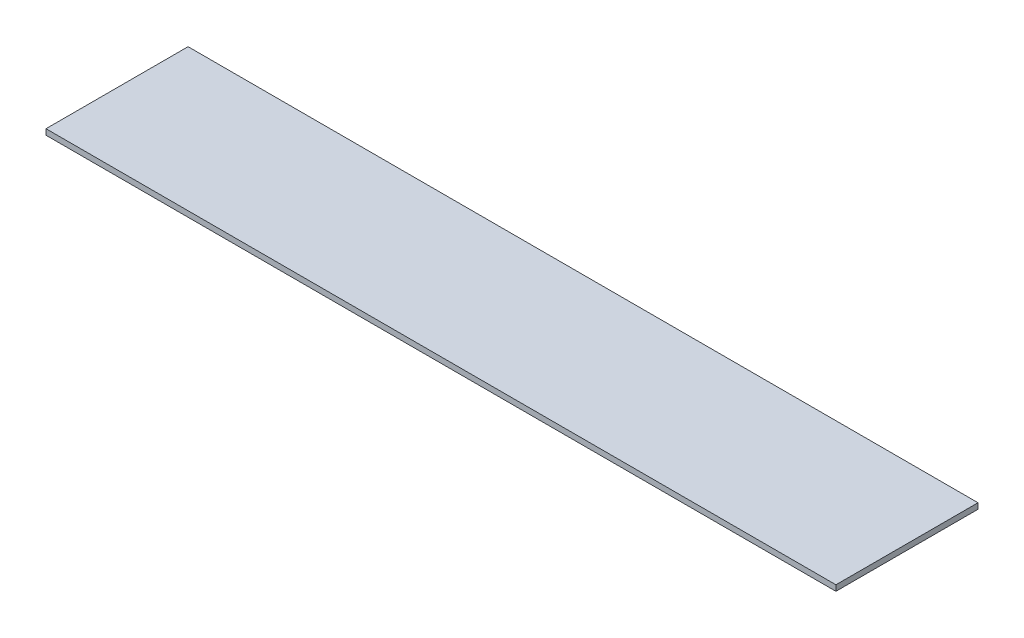
ISO-10303-21;
HEADER;
FILE_DESCRIPTION(('STEP AP214'),'2;1');
FILE_NAME('part.step','',(''),(''),'','','');
FILE_SCHEMA(('AUTOMOTIVE_DESIGN { 1 0 10303 214 1 1 1 1 }'));
ENDSEC;
DATA;
#1=APPLICATION_CONTEXT('core data for automotive mechanical design processes');
#2=APPLICATION_PROTOCOL_DEFINITION('international standard','automotive_design',2000,#1);
#3=PRODUCT_CONTEXT('',#1,'mechanical');
#4=PRODUCT('Part','Part','',(#3));
#5=PRODUCT_RELATED_PRODUCT_CATEGORY('part','',(#4));
#6=PRODUCT_DEFINITION_FORMATION('','',#4);
#7=PRODUCT_DEFINITION_CONTEXT('part definition',#1,'design');
#8=PRODUCT_DEFINITION('design','',#6,#7);
#9=PRODUCT_DEFINITION_SHAPE('','',#8);
#10=(LENGTH_UNIT() NAMED_UNIT(*) SI_UNIT(.MILLI.,.METRE.));
#11=(NAMED_UNIT(*) PLANE_ANGLE_UNIT() SI_UNIT($,.RADIAN.));
#12=(NAMED_UNIT(*) SI_UNIT($,.STERADIAN.) SOLID_ANGLE_UNIT());
#13=UNCERTAINTY_MEASURE_WITH_UNIT(LENGTH_MEASURE(1.E-05),#10,'distance_accuracy_value','');
#14=(GEOMETRIC_REPRESENTATION_CONTEXT(3) GLOBAL_UNCERTAINTY_ASSIGNED_CONTEXT((#13)) GLOBAL_UNIT_ASSIGNED_CONTEXT((#10,
#11,#12)) REPRESENTATION_CONTEXT('',''));
#15=CARTESIAN_POINT('',(0.,0.,0.));
#16=DIRECTION('',(0.,0.,1.));
#17=DIRECTION('',(1.,0.,0.));
#18=AXIS2_PLACEMENT_3D('',#15,#16,#17);
#19=CARTESIAN_POINT('',(0.,2.,0.));
#20=DIRECTION('',(1.,0.,0.));
#21=DIRECTION('',(0.,0.,-1.));
#22=AXIS2_PLACEMENT_3D('',#19,#20,#21);
#23=PLANE('',#22);
#24=DIRECTION('',(0.,0.,1.));
#25=VECTOR('',#24,1.);
#26=CARTESIAN_POINT('',(0.,0.,0.));
#27=LINE('',#26,#25);
#28=CARTESIAN_POINT('',(0.,0.,-50.));
#29=VERTEX_POINT('',#28);
#30=CARTESIAN_POINT('',(0.,0.,0.));
#31=VERTEX_POINT('',#30);
#32=EDGE_CURVE('E96',#29,#31,#27,.T.);
#33=ORIENTED_EDGE('',*,*,#32,.T.);
#34=DIRECTION('',(0.,-1.,0.));
#35=VECTOR('',#34,1.);
#36=CARTESIAN_POINT('',(0.,2.,0.));
#37=LINE('',#36,#35);
#38=CARTESIAN_POINT('',(0.,2.,0.));
#39=VERTEX_POINT('',#38);
#40=EDGE_CURVE('E11',#39,#31,#37,.T.);
#41=ORIENTED_EDGE('',*,*,#40,.F.);
#42=DIRECTION('',(0.,0.,1.));
#43=VECTOR('',#42,1.);
#44=CARTESIAN_POINT('',(0.,2.,0.));
#45=LINE('',#44,#43);
#46=CARTESIAN_POINT('',(0.,2.,-50.));
#47=VERTEX_POINT('',#46);
#48=EDGE_CURVE('E84',#47,#39,#45,.T.);
#49=ORIENTED_EDGE('',*,*,#48,.F.);
#50=DIRECTION('',(0.,-1.,0.));
#51=VECTOR('',#50,1.);
#52=CARTESIAN_POINT('',(0.,2.,-50.));
#53=LINE('',#52,#51);
#54=EDGE_CURVE('E92',#47,#29,#53,.T.);
#55=ORIENTED_EDGE('',*,*,#54,.T.);
#56=EDGE_LOOP('',(#33,#41,#49,#55));
#57=FACE_BOUND('',#56,.T.);
#58=ADVANCED_FACE('F33',(#57),#23,.F.);
#59=CARTESIAN_POINT('',(0.,2.,0.));
#60=DIRECTION('',(0.,0.,-1.));
#61=DIRECTION('',(-1.,0.,0.));
#62=AXIS2_PLACEMENT_3D('',#59,#60,#61);
#63=PLANE('',#62);
#64=DIRECTION('',(1.,0.,0.));
#65=VECTOR('',#64,1.);
#66=CARTESIAN_POINT('',(0.,0.,0.));
#67=LINE('',#66,#65);
#68=CARTESIAN_POINT('',(278.,0.,0.));
#69=VERTEX_POINT('',#68);
#70=EDGE_CURVE('E88',#31,#69,#67,.T.);
#71=ORIENTED_EDGE('',*,*,#70,.T.);
#72=DIRECTION('',(0.,-1.,0.));
#73=VECTOR('',#72,1.);
#74=CARTESIAN_POINT('',(278.,2.,0.));
#75=LINE('',#74,#73);
#76=CARTESIAN_POINT('',(278.,2.,0.));
#77=VERTEX_POINT('',#76);
#78=EDGE_CURVE('E41',#77,#69,#75,.T.);
#79=ORIENTED_EDGE('',*,*,#78,.F.);
#80=DIRECTION('',(1.,0.,0.));
#81=VECTOR('',#80,1.);
#82=CARTESIAN_POINT('',(0.,2.,0.));
#83=LINE('',#82,#81);
#84=EDGE_CURVE('E79',#39,#77,#83,.T.);
#85=ORIENTED_EDGE('',*,*,#84,.F.);
#86=ORIENTED_EDGE('',*,*,#40,.T.);
#87=EDGE_LOOP('',(#71,#79,#85,#86));
#88=FACE_BOUND('',#87,.T.);
#89=ADVANCED_FACE('F87',(#88),#63,.F.);
#90=CARTESIAN_POINT('',(278.,2.,0.));
#91=DIRECTION('',(-1.,0.,0.));
#92=DIRECTION('',(0.,0.,1.));
#93=AXIS2_PLACEMENT_3D('',#90,#91,#92);
#94=PLANE('',#93);
#95=DIRECTION('',(0.,0.,-1.));
#96=VECTOR('',#95,1.);
#97=CARTESIAN_POINT('',(278.,0.,0.));
#98=LINE('',#97,#96);
#99=CARTESIAN_POINT('',(278.,0.,-50.));
#100=VERTEX_POINT('',#99);
#101=EDGE_CURVE('E66',#69,#100,#98,.T.);
#102=ORIENTED_EDGE('',*,*,#101,.T.);
#103=DIRECTION('',(0.,-1.,0.));
#104=VECTOR('',#103,1.);
#105=CARTESIAN_POINT('',(278.,2.,-50.));
#106=LINE('',#105,#104);
#107=CARTESIAN_POINT('',(278.,2.,-50.));
#108=VERTEX_POINT('',#107);
#109=EDGE_CURVE('E89',#108,#100,#106,.T.);
#110=ORIENTED_EDGE('',*,*,#109,.F.);
#111=DIRECTION('',(0.,0.,-1.));
#112=VECTOR('',#111,1.);
#113=CARTESIAN_POINT('',(278.,2.,0.));
#114=LINE('',#113,#112);
#115=EDGE_CURVE('E82',#77,#108,#114,.T.);
#116=ORIENTED_EDGE('',*,*,#115,.F.);
#117=ORIENTED_EDGE('',*,*,#78,.T.);
#118=EDGE_LOOP('',(#102,#110,#116,#117));
#119=FACE_BOUND('',#118,.T.);
#120=ADVANCED_FACE('F90',(#119),#94,.F.);
#121=CARTESIAN_POINT('',(0.,2.,-50.));
#122=DIRECTION('',(0.,0.,1.));
#123=DIRECTION('',(1.,0.,0.));
#124=AXIS2_PLACEMENT_3D('',#121,#122,#123);
#125=PLANE('',#124);
#126=DIRECTION('',(-1.,0.,0.));
#127=VECTOR('',#126,1.);
#128=CARTESIAN_POINT('',(0.,0.,-50.));
#129=LINE('',#128,#127);
#130=EDGE_CURVE('E72',#100,#29,#129,.T.);
#131=ORIENTED_EDGE('',*,*,#130,.T.);
#132=ORIENTED_EDGE('',*,*,#54,.F.);
#133=DIRECTION('',(-1.,0.,0.));
#134=VECTOR('',#133,1.);
#135=CARTESIAN_POINT('',(0.,2.,-50.));
#136=LINE('',#135,#134);
#137=EDGE_CURVE('E49',#108,#47,#136,.T.);
#138=ORIENTED_EDGE('',*,*,#137,.F.);
#139=ORIENTED_EDGE('',*,*,#109,.T.);
#140=EDGE_LOOP('',(#131,#132,#138,#139));
#141=FACE_BOUND('',#140,.T.);
#142=ADVANCED_FACE('F103',(#141),#125,.F.);
#143=CARTESIAN_POINT('',(0.,2.,0.));
#144=DIRECTION('',(0.,-1.,0.));
#145=DIRECTION('',(0.,0.,-1.));
#146=AXIS2_PLACEMENT_3D('',#143,#144,#145);
#147=PLANE('',#146);
#148=ORIENTED_EDGE('',*,*,#48,.T.);
#149=ORIENTED_EDGE('',*,*,#84,.T.);
#150=ORIENTED_EDGE('',*,*,#115,.T.);
#151=ORIENTED_EDGE('',*,*,#137,.T.);
#152=EDGE_LOOP('',(#148,#149,#150,#151));
#153=FACE_BOUND('',#152,.T.);
#154=ADVANCED_FACE('F80',(#153),#147,.F.);
#155=CARTESIAN_POINT('',(0.,0.,0.));
#156=DIRECTION('',(0.,-1.,0.));
#157=DIRECTION('',(0.,0.,-1.));
#158=AXIS2_PLACEMENT_3D('',#155,#156,#157);
#159=PLANE('',#158);
#160=ORIENTED_EDGE('',*,*,#32,.F.);
#161=ORIENTED_EDGE('',*,*,#130,.F.);
#162=ORIENTED_EDGE('',*,*,#101,.F.);
#163=ORIENTED_EDGE('',*,*,#70,.F.);
#164=EDGE_LOOP('',(#160,#161,#162,#163));
#165=FACE_BOUND('',#164,.T.);
#166=ADVANCED_FACE('F106',(#165),#159,.T.);
#167=CLOSED_SHELL('',(#58,#89,#120,#142,#154,#166));
#168=MANIFOLD_SOLID_BREP('B2',#167);
#169=ADVANCED_BREP_SHAPE_REPRESENTATION('',(#18,#168),#14);
#170=SHAPE_DEFINITION_REPRESENTATION(#9,#169);
ENDSEC;
END-ISO-10303-21;
